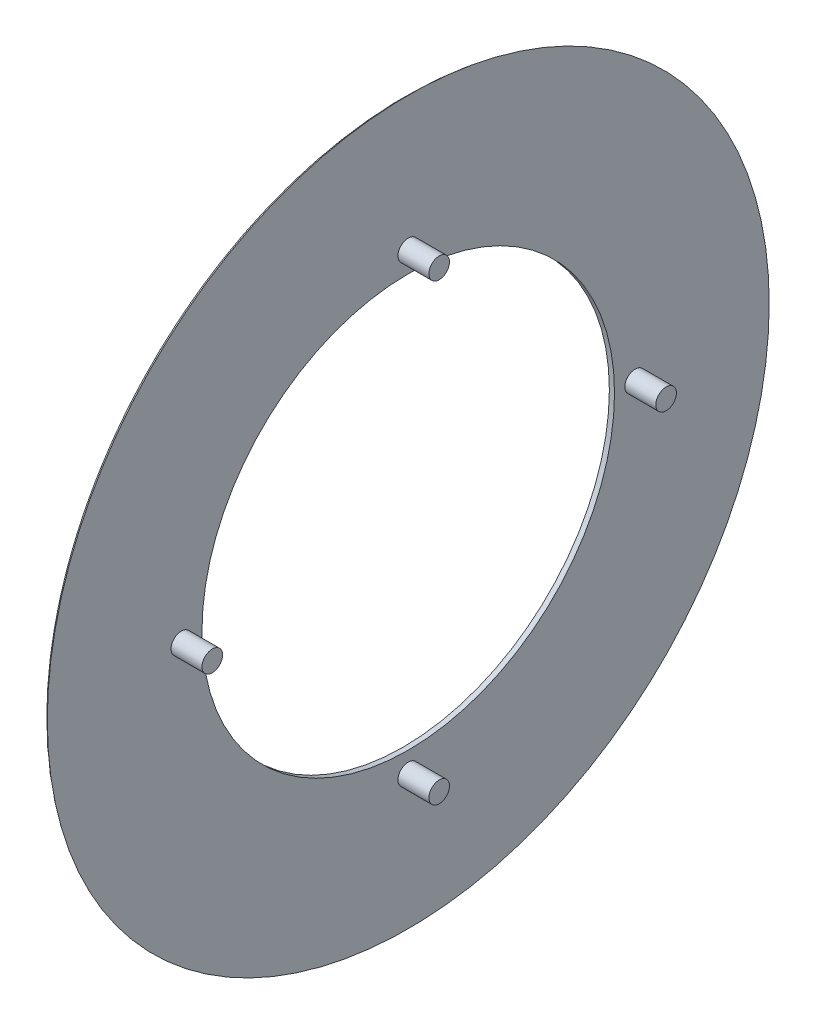
ISO-10303-21;
HEADER;
FILE_DESCRIPTION(('STEP AP214'),'2;1');
FILE_NAME('part.step','',(''),(''),'','','');
FILE_SCHEMA(('AUTOMOTIVE_DESIGN { 1 0 10303 214 1 1 1 1 }'));
ENDSEC;
DATA;
#1=APPLICATION_CONTEXT('core data for automotive mechanical design processes');
#2=APPLICATION_PROTOCOL_DEFINITION('international standard','automotive_design',2000,#1);
#3=PRODUCT_CONTEXT('',#1,'mechanical');
#4=PRODUCT('Part','Part','',(#3));
#5=PRODUCT_RELATED_PRODUCT_CATEGORY('part','',(#4));
#6=PRODUCT_DEFINITION_FORMATION('','',#4);
#7=PRODUCT_DEFINITION_CONTEXT('part definition',#1,'design');
#8=PRODUCT_DEFINITION('design','',#6,#7);
#9=PRODUCT_DEFINITION_SHAPE('','',#8);
#10=(LENGTH_UNIT() NAMED_UNIT(*) SI_UNIT(.MILLI.,.METRE.));
#11=(NAMED_UNIT(*) PLANE_ANGLE_UNIT() SI_UNIT($,.RADIAN.));
#12=(NAMED_UNIT(*) SI_UNIT($,.STERADIAN.) SOLID_ANGLE_UNIT());
#13=UNCERTAINTY_MEASURE_WITH_UNIT(LENGTH_MEASURE(1.E-05),#10,'distance_accuracy_value','');
#14=(GEOMETRIC_REPRESENTATION_CONTEXT(3) GLOBAL_UNCERTAINTY_ASSIGNED_CONTEXT((#13)) GLOBAL_UNIT_ASSIGNED_CONTEXT((#10,
#11,#12)) REPRESENTATION_CONTEXT('',''));
#15=CARTESIAN_POINT('',(0.,0.,0.));
#16=DIRECTION('',(0.,0.,1.));
#17=DIRECTION('',(1.,0.,0.));
#18=AXIS2_PLACEMENT_3D('',#15,#16,#17);
#19=CARTESIAN_POINT('',(0.635,0.,0.));
#20=DIRECTION('',(1.,0.,0.));
#21=DIRECTION('',(0.,0.,-1.));
#22=AXIS2_PLACEMENT_3D('',#19,#20,#21);
#23=PLANE('',#22);
#24=CARTESIAN_POINT('',(0.635,0.,0.));
#25=DIRECTION('',(1.,0.,0.));
#26=DIRECTION('',(0.,0.,-1.));
#27=AXIS2_PLACEMENT_3D('',#24,#25,#26);
#28=CIRCLE('',#27,25.4);
#29=CARTESIAN_POINT('',(0.635,0.,-25.4));
#30=VERTEX_POINT('',#29);
#31=EDGE_CURVE('E74',#30,#30,#28,.T.);
#32=ORIENTED_EDGE('',*,*,#31,.F.);
#33=EDGE_LOOP('',(#32));
#34=FACE_BOUND('',#33,.T.);
#35=CARTESIAN_POINT('',(0.635,-27.94,0.));
#36=DIRECTION('',(1.,0.,0.));
#37=DIRECTION('',(0.,0.,-1.));
#38=AXIS2_PLACEMENT_3D('',#35,#36,#37);
#39=CIRCLE('',#38,1.27);
#40=CARTESIAN_POINT('',(0.635,-27.94,1.26999999999999));
#41=VERTEX_POINT('',#40);
#42=EDGE_CURVE('E60',#41,#41,#39,.T.);
#43=ORIENTED_EDGE('',*,*,#42,.F.);
#44=EDGE_LOOP('',(#43));
#45=FACE_BOUND('',#44,.T.);
#46=CARTESIAN_POINT('',(0.635,27.94,0.));
#47=DIRECTION('',(1.,0.,0.));
#48=DIRECTION('',(0.,0.,-1.));
#49=AXIS2_PLACEMENT_3D('',#46,#47,#48);
#50=CIRCLE('',#49,1.27);
#51=CARTESIAN_POINT('',(0.635,27.94,1.27));
#52=VERTEX_POINT('',#51);
#53=EDGE_CURVE('E48',#52,#52,#50,.T.);
#54=ORIENTED_EDGE('',*,*,#53,.F.);
#55=EDGE_LOOP('',(#54));
#56=FACE_BOUND('',#55,.T.);
#57=CARTESIAN_POINT('',(0.635,0.,0.));
#58=DIRECTION('',(1.,0.,0.));
#59=DIRECTION('',(0.,0.,-1.));
#60=AXIS2_PLACEMENT_3D('',#57,#58,#59);
#61=CIRCLE('',#60,44.45);
#62=CARTESIAN_POINT('',(0.635,0.,-44.45));
#63=VERTEX_POINT('',#62);
#64=EDGE_CURVE('E40',#63,#63,#61,.T.);
#65=ORIENTED_EDGE('',*,*,#64,.T.);
#66=EDGE_LOOP('',(#65));
#67=FACE_BOUND('',#66,.T.);
#68=CARTESIAN_POINT('',(0.635,0.,-27.94));
#69=DIRECTION('',(1.,0.,0.));
#70=DIRECTION('',(0.,0.,-1.));
#71=AXIS2_PLACEMENT_3D('',#68,#69,#70);
#72=CIRCLE('',#71,1.27);
#73=CARTESIAN_POINT('',(0.635,0.,-26.67));
#74=VERTEX_POINT('',#73);
#75=EDGE_CURVE('E54',#74,#74,#72,.T.);
#76=ORIENTED_EDGE('',*,*,#75,.F.);
#77=EDGE_LOOP('',(#76));
#78=FACE_BOUND('',#77,.T.);
#79=CARTESIAN_POINT('',(0.635,0.,27.94));
#80=DIRECTION('',(1.,0.,0.));
#81=DIRECTION('',(0.,0.,-1.));
#82=AXIS2_PLACEMENT_3D('',#79,#80,#81);
#83=CIRCLE('',#82,1.27);
#84=CARTESIAN_POINT('',(0.635,0.,29.21));
#85=VERTEX_POINT('',#84);
#86=EDGE_CURVE('E66',#85,#85,#83,.T.);
#87=ORIENTED_EDGE('',*,*,#86,.F.);
#88=EDGE_LOOP('',(#87));
#89=FACE_BOUND('',#88,.T.);
#90=ADVANCED_FACE('F33',(#34,#45,#56,#67,#78,#89),#23,.T.);
#91=CARTESIAN_POINT('',(0.,0.,0.));
#92=DIRECTION('',(1.,0.,0.));
#93=DIRECTION('',(0.,0.,-1.));
#94=AXIS2_PLACEMENT_3D('',#91,#92,#93);
#95=PLANE('',#94);
#96=CARTESIAN_POINT('',(0.,0.,0.));
#97=DIRECTION('',(1.,0.,0.));
#98=DIRECTION('',(0.,0.,-1.));
#99=AXIS2_PLACEMENT_3D('',#96,#97,#98);
#100=CIRCLE('',#99,43.3501477371938);
#101=CARTESIAN_POINT('',(0.,0.,-43.3501477371938));
#102=VERTEX_POINT('',#101);
#103=EDGE_CURVE('E10',#102,#102,#100,.F.);
#104=ORIENTED_EDGE('',*,*,#103,.T.);
#105=EDGE_LOOP('',(#104));
#106=FACE_BOUND('',#105,.T.);
#107=CARTESIAN_POINT('',(0.,0.,0.));
#108=DIRECTION('',(1.,0.,0.));
#109=DIRECTION('',(0.,0.,-1.));
#110=AXIS2_PLACEMENT_3D('',#107,#108,#109);
#111=CIRCLE('',#110,25.4);
#112=CARTESIAN_POINT('',(0.,0.,-25.4));
#113=VERTEX_POINT('',#112);
#114=EDGE_CURVE('E69',#113,#113,#111,.F.);
#115=ORIENTED_EDGE('',*,*,#114,.F.);
#116=EDGE_LOOP('',(#115));
#117=FACE_BOUND('',#116,.T.);
#118=ADVANCED_FACE('F83',(#106,#117),#95,.F.);
#119=CARTESIAN_POINT('',(4.445,27.94,0.));
#120=DIRECTION('',(-1.,0.,0.));
#121=DIRECTION('',(0.,0.,1.));
#122=AXIS2_PLACEMENT_3D('',#119,#120,#121);
#123=CYLINDRICAL_SURFACE('',#122,1.27);
#124=CARTESIAN_POINT('',(4.445,27.94,0.));
#125=DIRECTION('',(1.,0.,0.));
#126=DIRECTION('',(0.,0.,-1.));
#127=AXIS2_PLACEMENT_3D('',#124,#125,#126);
#128=CIRCLE('',#127,1.27);
#129=CARTESIAN_POINT('',(4.445,27.94,1.27));
#130=VERTEX_POINT('',#129);
#131=EDGE_CURVE('E44',#130,#130,#128,.T.);
#132=CARTESIAN_POINT('',(4.445,27.94,1.27));
#133=CARTESIAN_POINT('',(4.4053125,27.94,1.27));
#134=CARTESIAN_POINT('',(4.365625,27.94,1.27));
#135=CARTESIAN_POINT('',(4.28625,27.94,1.27));
#136=CARTESIAN_POINT('',(4.2465625,27.94,1.27));
#137=CARTESIAN_POINT('',(4.1671875,27.94,1.27));
#138=CARTESIAN_POINT('',(4.1275,27.94,1.27));
#139=CARTESIAN_POINT('',(4.048125,27.94,1.27));
#140=CARTESIAN_POINT('',(4.0084375,27.94,1.27));
#141=CARTESIAN_POINT('',(3.9290625,27.94,1.27));
#142=CARTESIAN_POINT('',(3.889375,27.94,1.27));
#143=CARTESIAN_POINT('',(3.81,27.94,1.27));
#144=CARTESIAN_POINT('',(3.7703125,27.94,1.27));
#145=CARTESIAN_POINT('',(3.6909375,27.94,1.27));
#146=CARTESIAN_POINT('',(3.65125,27.94,1.27));
#147=CARTESIAN_POINT('',(3.571875,27.94,1.27));
#148=CARTESIAN_POINT('',(3.5321875,27.94,1.27));
#149=CARTESIAN_POINT('',(3.4528125,27.94,1.27));
#150=CARTESIAN_POINT('',(3.413125,27.94,1.27));
#151=CARTESIAN_POINT('',(3.33375,27.94,1.27));
#152=CARTESIAN_POINT('',(3.2940625,27.94,1.27));
#153=CARTESIAN_POINT('',(3.2146875,27.94,1.27));
#154=CARTESIAN_POINT('',(3.175,27.94,1.27));
#155=CARTESIAN_POINT('',(3.095625,27.94,1.27));
#156=CARTESIAN_POINT('',(3.0559375,27.94,1.27));
#157=CARTESIAN_POINT('',(2.9765625,27.94,1.27));
#158=CARTESIAN_POINT('',(2.936875,27.94,1.27));
#159=CARTESIAN_POINT('',(2.8575,27.94,1.27));
#160=CARTESIAN_POINT('',(2.8178125,27.94,1.27));
#161=CARTESIAN_POINT('',(2.7384375,27.94,1.27));
#162=CARTESIAN_POINT('',(2.69875,27.94,1.27));
#163=CARTESIAN_POINT('',(2.619375,27.94,1.27));
#164=CARTESIAN_POINT('',(2.5796875,27.94,1.27));
#165=CARTESIAN_POINT('',(2.5003125,27.94,1.27));
#166=CARTESIAN_POINT('',(2.460625,27.94,1.27));
#167=CARTESIAN_POINT('',(2.38125,27.94,1.27));
#168=CARTESIAN_POINT('',(2.3415625,27.94,1.27));
#169=CARTESIAN_POINT('',(2.2621875,27.94,1.27));
#170=CARTESIAN_POINT('',(2.2225,27.94,1.27));
#171=CARTESIAN_POINT('',(2.143125,27.94,1.27));
#172=CARTESIAN_POINT('',(2.1034375,27.94,1.27));
#173=CARTESIAN_POINT('',(2.0240625,27.94,1.27));
#174=CARTESIAN_POINT('',(1.984375,27.94,1.27));
#175=CARTESIAN_POINT('',(1.905,27.94,1.27));
#176=CARTESIAN_POINT('',(1.8653125,27.94,1.27));
#177=CARTESIAN_POINT('',(1.7859375,27.94,1.27));
#178=CARTESIAN_POINT('',(1.74625,27.94,1.27));
#179=CARTESIAN_POINT('',(1.666875,27.94,1.27));
#180=CARTESIAN_POINT('',(1.6271875,27.94,1.27));
#181=CARTESIAN_POINT('',(1.5478125,27.94,1.27));
#182=CARTESIAN_POINT('',(1.508125,27.94,1.27));
#183=CARTESIAN_POINT('',(1.42875,27.94,1.27));
#184=CARTESIAN_POINT('',(1.3890625,27.94,1.27));
#185=CARTESIAN_POINT('',(1.3096875,27.94,1.27));
#186=CARTESIAN_POINT('',(1.27,27.94,1.27));
#187=CARTESIAN_POINT('',(1.190625,27.94,1.27));
#188=CARTESIAN_POINT('',(1.1509375,27.94,1.27));
#189=CARTESIAN_POINT('',(1.0715625,27.94,1.27));
#190=CARTESIAN_POINT('',(1.031875,27.94,1.27));
#191=CARTESIAN_POINT('',(0.9525,27.94,1.27));
#192=CARTESIAN_POINT('',(0.9128125,27.94,1.27));
#193=CARTESIAN_POINT('',(0.8334375,27.94,1.27));
#194=CARTESIAN_POINT('',(0.79375,27.94,1.27));
#195=CARTESIAN_POINT('',(0.714375,27.94,1.27));
#196=CARTESIAN_POINT('',(0.6746875,27.94,1.27));
#197=CARTESIAN_POINT('',(0.635,27.94,1.27));
#198=B_SPLINE_CURVE_WITH_KNOTS('',3,(#132,#133,#134,#135,#136,#137,#138,#139,#140,#141,#142,
#143,#144,#145,#146,#147,#148,#149,#150,#151,#152,#153,#154,#155,#156,#157,#158,#159,#160,#161,
#162,#163,#164,#165,#166,#167,#168,#169,#170,#171,#172,#173,#174,#175,#176,#177,#178,#179,#180,
#181,#182,#183,#184,#185,#186,#187,#188,#189,#190,#191,#192,#193,#194,#195,#196,#197),
.UNSPECIFIED.,.F.,.F.,(4,2,2,2,2,2,2,2,2,2,2,2,2,2,2,2,2,2,2,2,2,2,2,2,2,2,2,2,2,2,2,2,4),(0.,
0.119062499999999,0.238125,0.3571875,0.476249999999999,0.595312499999999,0.714374999999999,
0.833437499999999,0.952499999999999,1.0715625,1.190625,1.3096875,1.42875,1.5478125,1.666875,
1.7859375,1.905,2.0240625,2.143125,2.2621875,2.38125,2.5003125,2.619375,2.7384375,2.8575,
2.9765625,3.095625,3.2146875,3.33375,3.4528125,3.571875,3.6909375,3.81),.UNSPECIFIED.);
#199=EDGE_CURVE('BSEAM125',#130,#52,#198,.T.);
#200=ORIENTED_EDGE('',*,*,#131,.F.);
#201=ORIENTED_EDGE('',*,*,#53,.T.);
#202=ORIENTED_EDGE('',*,*,#199,.T.);
#203=ORIENTED_EDGE('',*,*,#199,.F.);
#204=EDGE_LOOP('',(#200,#202,#201,#203));
#205=FACE_BOUND('',#204,.T.);
#206=ADVANCED_FACE('F125',(#205),#123,.T.);
#207=CARTESIAN_POINT('',(4.445,27.94,0.));
#208=DIRECTION('',(1.,0.,0.));
#209=DIRECTION('',(0.,0.,-1.));
#210=AXIS2_PLACEMENT_3D('',#207,#208,#209);
#211=PLANE('',#210);
#212=ORIENTED_EDGE('',*,*,#131,.T.);
#213=EDGE_LOOP('',(#212));
#214=FACE_BOUND('',#213,.T.);
#215=ADVANCED_FACE('F121',(#214),#211,.T.);
#216=CARTESIAN_POINT('',(4.445,0.,-27.94));
#217=DIRECTION('',(-1.,0.,0.));
#218=DIRECTION('',(0.,0.,1.));
#219=AXIS2_PLACEMENT_3D('',#216,#217,#218);
#220=CYLINDRICAL_SURFACE('',#219,1.27);
#221=CARTESIAN_POINT('',(4.445,0.,-27.94));
#222=DIRECTION('',(1.,0.,0.));
#223=DIRECTION('',(0.,0.,-1.));
#224=AXIS2_PLACEMENT_3D('',#221,#222,#223);
#225=CIRCLE('',#224,1.27);
#226=CARTESIAN_POINT('',(4.445,0.,-26.67));
#227=VERTEX_POINT('',#226);
#228=EDGE_CURVE('E52',#227,#227,#225,.T.);
#229=CARTESIAN_POINT('',(4.445,0.,-26.67));
#230=CARTESIAN_POINT('',(4.4053125,0.,-26.67));
#231=CARTESIAN_POINT('',(4.365625,0.,-26.67));
#232=CARTESIAN_POINT('',(4.28625,0.,-26.67));
#233=CARTESIAN_POINT('',(4.2465625,0.,-26.67));
#234=CARTESIAN_POINT('',(4.1671875,0.,-26.67));
#235=CARTESIAN_POINT('',(4.1275,0.,-26.67));
#236=CARTESIAN_POINT('',(4.048125,0.,-26.67));
#237=CARTESIAN_POINT('',(4.0084375,0.,-26.67));
#238=CARTESIAN_POINT('',(3.9290625,0.,-26.67));
#239=CARTESIAN_POINT('',(3.889375,0.,-26.67));
#240=CARTESIAN_POINT('',(3.81,0.,-26.67));
#241=CARTESIAN_POINT('',(3.7703125,0.,-26.67));
#242=CARTESIAN_POINT('',(3.6909375,0.,-26.67));
#243=CARTESIAN_POINT('',(3.65125,0.,-26.67));
#244=CARTESIAN_POINT('',(3.571875,0.,-26.67));
#245=CARTESIAN_POINT('',(3.5321875,0.,-26.67));
#246=CARTESIAN_POINT('',(3.4528125,0.,-26.67));
#247=CARTESIAN_POINT('',(3.413125,0.,-26.67));
#248=CARTESIAN_POINT('',(3.33375,0.,-26.67));
#249=CARTESIAN_POINT('',(3.2940625,0.,-26.67));
#250=CARTESIAN_POINT('',(3.2146875,0.,-26.67));
#251=CARTESIAN_POINT('',(3.175,0.,-26.67));
#252=CARTESIAN_POINT('',(3.095625,0.,-26.67));
#253=CARTESIAN_POINT('',(3.0559375,0.,-26.67));
#254=CARTESIAN_POINT('',(2.9765625,0.,-26.67));
#255=CARTESIAN_POINT('',(2.936875,0.,-26.67));
#256=CARTESIAN_POINT('',(2.8575,0.,-26.67));
#257=CARTESIAN_POINT('',(2.8178125,0.,-26.67));
#258=CARTESIAN_POINT('',(2.7384375,0.,-26.67));
#259=CARTESIAN_POINT('',(2.69875,0.,-26.67));
#260=CARTESIAN_POINT('',(2.619375,0.,-26.67));
#261=CARTESIAN_POINT('',(2.5796875,0.,-26.67));
#262=CARTESIAN_POINT('',(2.5003125,0.,-26.67));
#263=CARTESIAN_POINT('',(2.460625,0.,-26.67));
#264=CARTESIAN_POINT('',(2.38125,0.,-26.67));
#265=CARTESIAN_POINT('',(2.3415625,0.,-26.67));
#266=CARTESIAN_POINT('',(2.2621875,0.,-26.67));
#267=CARTESIAN_POINT('',(2.2225,0.,-26.67));
#268=CARTESIAN_POINT('',(2.143125,0.,-26.67));
#269=CARTESIAN_POINT('',(2.1034375,0.,-26.67));
#270=CARTESIAN_POINT('',(2.0240625,0.,-26.67));
#271=CARTESIAN_POINT('',(1.984375,0.,-26.67));
#272=CARTESIAN_POINT('',(1.905,0.,-26.67));
#273=CARTESIAN_POINT('',(1.8653125,0.,-26.67));
#274=CARTESIAN_POINT('',(1.7859375,0.,-26.67));
#275=CARTESIAN_POINT('',(1.74625,0.,-26.67));
#276=CARTESIAN_POINT('',(1.666875,0.,-26.67));
#277=CARTESIAN_POINT('',(1.6271875,0.,-26.67));
#278=CARTESIAN_POINT('',(1.5478125,0.,-26.67));
#279=CARTESIAN_POINT('',(1.508125,0.,-26.67));
#280=CARTESIAN_POINT('',(1.42875,0.,-26.67));
#281=CARTESIAN_POINT('',(1.3890625,0.,-26.67));
#282=CARTESIAN_POINT('',(1.3096875,0.,-26.67));
#283=CARTESIAN_POINT('',(1.27,0.,-26.67));
#284=CARTESIAN_POINT('',(1.190625,0.,-26.67));
#285=CARTESIAN_POINT('',(1.1509375,0.,-26.67));
#286=CARTESIAN_POINT('',(1.0715625,0.,-26.67));
#287=CARTESIAN_POINT('',(1.031875,0.,-26.67));
#288=CARTESIAN_POINT('',(0.9525,0.,-26.67));
#289=CARTESIAN_POINT('',(0.9128125,0.,-26.67));
#290=CARTESIAN_POINT('',(0.8334375,0.,-26.67));
#291=CARTESIAN_POINT('',(0.79375,0.,-26.67));
#292=CARTESIAN_POINT('',(0.714375,0.,-26.67));
#293=CARTESIAN_POINT('',(0.6746875,0.,-26.67));
#294=CARTESIAN_POINT('',(0.635,0.,-26.67));
#295=B_SPLINE_CURVE_WITH_KNOTS('',3,(#229,#230,#231,#232,#233,#234,#235,#236,#237,#238,#239,
#240,#241,#242,#243,#244,#245,#246,#247,#248,#249,#250,#251,#252,#253,#254,#255,#256,#257,#258,
#259,#260,#261,#262,#263,#264,#265,#266,#267,#268,#269,#270,#271,#272,#273,#274,#275,#276,#277,
#278,#279,#280,#281,#282,#283,#284,#285,#286,#287,#288,#289,#290,#291,#292,#293,#294),
.UNSPECIFIED.,.F.,.F.,(4,2,2,2,2,2,2,2,2,2,2,2,2,2,2,2,2,2,2,2,2,2,2,2,2,2,2,2,2,2,2,2,4),(0.,
0.119062499999999,0.238125,0.3571875,0.476249999999999,0.595312499999999,0.714374999999999,
0.833437499999999,0.952499999999999,1.0715625,1.190625,1.3096875,1.42875,1.5478125,1.666875,
1.7859375,1.905,2.0240625,2.143125,2.2621875,2.38125,2.5003125,2.619375,2.7384375,2.8575,
2.9765625,3.095625,3.2146875,3.33375,3.4528125,3.571875,3.6909375,3.81),.UNSPECIFIED.);
#296=EDGE_CURVE('BSEAM117',#227,#74,#295,.T.);
#297=ORIENTED_EDGE('',*,*,#228,.F.);
#298=ORIENTED_EDGE('',*,*,#75,.T.);
#299=ORIENTED_EDGE('',*,*,#296,.T.);
#300=ORIENTED_EDGE('',*,*,#296,.F.);
#301=EDGE_LOOP('',(#297,#299,#298,#300));
#302=FACE_BOUND('',#301,.T.);
#303=ADVANCED_FACE('F117',(#302),#220,.T.);
#304=CARTESIAN_POINT('',(4.445,0.,-27.94));
#305=DIRECTION('',(1.,0.,0.));
#306=DIRECTION('',(0.,0.,-1.));
#307=AXIS2_PLACEMENT_3D('',#304,#305,#306);
#308=PLANE('',#307);
#309=ORIENTED_EDGE('',*,*,#228,.T.);
#310=EDGE_LOOP('',(#309));
#311=FACE_BOUND('',#310,.T.);
#312=ADVANCED_FACE('F113',(#311),#308,.T.);
#313=CARTESIAN_POINT('',(4.445,-27.94,0.));
#314=DIRECTION('',(-1.,0.,0.));
#315=DIRECTION('',(0.,0.,1.));
#316=AXIS2_PLACEMENT_3D('',#313,#314,#315);
#317=CYLINDRICAL_SURFACE('',#316,1.27);
#318=CARTESIAN_POINT('',(4.445,-27.94,0.));
#319=DIRECTION('',(1.,0.,0.));
#320=DIRECTION('',(0.,0.,-1.));
#321=AXIS2_PLACEMENT_3D('',#318,#319,#320);
#322=CIRCLE('',#321,1.27);
#323=CARTESIAN_POINT('',(4.445,-27.94,1.26999999999999));
#324=VERTEX_POINT('',#323);
#325=EDGE_CURVE('E57',#324,#324,#322,.T.);
#326=CARTESIAN_POINT('',(4.445,-27.94,1.26999999999999));
#327=CARTESIAN_POINT('',(4.4053125,-27.94,1.26999999999999));
#328=CARTESIAN_POINT('',(4.365625,-27.94,1.26999999999999));
#329=CARTESIAN_POINT('',(4.28625,-27.94,1.26999999999999));
#330=CARTESIAN_POINT('',(4.2465625,-27.94,1.26999999999999));
#331=CARTESIAN_POINT('',(4.1671875,-27.94,1.26999999999999));
#332=CARTESIAN_POINT('',(4.1275,-27.94,1.26999999999999));
#333=CARTESIAN_POINT('',(4.048125,-27.94,1.26999999999999));
#334=CARTESIAN_POINT('',(4.0084375,-27.94,1.26999999999999));
#335=CARTESIAN_POINT('',(3.9290625,-27.94,1.26999999999999));
#336=CARTESIAN_POINT('',(3.889375,-27.94,1.26999999999999));
#337=CARTESIAN_POINT('',(3.81,-27.94,1.26999999999999));
#338=CARTESIAN_POINT('',(3.7703125,-27.94,1.26999999999999));
#339=CARTESIAN_POINT('',(3.6909375,-27.94,1.26999999999999));
#340=CARTESIAN_POINT('',(3.65125,-27.94,1.26999999999999));
#341=CARTESIAN_POINT('',(3.571875,-27.94,1.26999999999999));
#342=CARTESIAN_POINT('',(3.5321875,-27.94,1.26999999999999));
#343=CARTESIAN_POINT('',(3.4528125,-27.94,1.26999999999999));
#344=CARTESIAN_POINT('',(3.413125,-27.94,1.26999999999999));
#345=CARTESIAN_POINT('',(3.33375,-27.94,1.26999999999999));
#346=CARTESIAN_POINT('',(3.2940625,-27.94,1.26999999999999));
#347=CARTESIAN_POINT('',(3.2146875,-27.94,1.26999999999999));
#348=CARTESIAN_POINT('',(3.175,-27.94,1.26999999999999));
#349=CARTESIAN_POINT('',(3.095625,-27.94,1.26999999999999));
#350=CARTESIAN_POINT('',(3.0559375,-27.94,1.26999999999999));
#351=CARTESIAN_POINT('',(2.9765625,-27.94,1.26999999999999));
#352=CARTESIAN_POINT('',(2.936875,-27.94,1.26999999999999));
#353=CARTESIAN_POINT('',(2.8575,-27.94,1.26999999999999));
#354=CARTESIAN_POINT('',(2.8178125,-27.94,1.26999999999999));
#355=CARTESIAN_POINT('',(2.7384375,-27.94,1.26999999999999));
#356=CARTESIAN_POINT('',(2.69875,-27.94,1.26999999999999));
#357=CARTESIAN_POINT('',(2.619375,-27.94,1.26999999999999));
#358=CARTESIAN_POINT('',(2.5796875,-27.94,1.26999999999999));
#359=CARTESIAN_POINT('',(2.5003125,-27.94,1.26999999999999));
#360=CARTESIAN_POINT('',(2.460625,-27.94,1.26999999999999));
#361=CARTESIAN_POINT('',(2.38125,-27.94,1.26999999999999));
#362=CARTESIAN_POINT('',(2.3415625,-27.94,1.26999999999999));
#363=CARTESIAN_POINT('',(2.2621875,-27.94,1.26999999999999));
#364=CARTESIAN_POINT('',(2.2225,-27.94,1.26999999999999));
#365=CARTESIAN_POINT('',(2.143125,-27.94,1.26999999999999));
#366=CARTESIAN_POINT('',(2.1034375,-27.94,1.26999999999999));
#367=CARTESIAN_POINT('',(2.0240625,-27.94,1.26999999999999));
#368=CARTESIAN_POINT('',(1.984375,-27.94,1.26999999999999));
#369=CARTESIAN_POINT('',(1.905,-27.94,1.26999999999999));
#370=CARTESIAN_POINT('',(1.8653125,-27.94,1.26999999999999));
#371=CARTESIAN_POINT('',(1.7859375,-27.94,1.26999999999999));
#372=CARTESIAN_POINT('',(1.74625,-27.94,1.26999999999999));
#373=CARTESIAN_POINT('',(1.666875,-27.94,1.26999999999999));
#374=CARTESIAN_POINT('',(1.6271875,-27.94,1.26999999999999));
#375=CARTESIAN_POINT('',(1.5478125,-27.94,1.26999999999999));
#376=CARTESIAN_POINT('',(1.508125,-27.94,1.26999999999999));
#377=CARTESIAN_POINT('',(1.42875,-27.94,1.26999999999999));
#378=CARTESIAN_POINT('',(1.3890625,-27.94,1.26999999999999));
#379=CARTESIAN_POINT('',(1.3096875,-27.94,1.26999999999999));
#380=CARTESIAN_POINT('',(1.27,-27.94,1.26999999999999));
#381=CARTESIAN_POINT('',(1.190625,-27.94,1.26999999999999));
#382=CARTESIAN_POINT('',(1.1509375,-27.94,1.26999999999999));
#383=CARTESIAN_POINT('',(1.0715625,-27.94,1.26999999999999));
#384=CARTESIAN_POINT('',(1.031875,-27.94,1.26999999999999));
#385=CARTESIAN_POINT('',(0.9525,-27.94,1.26999999999999));
#386=CARTESIAN_POINT('',(0.9128125,-27.94,1.26999999999999));
#387=CARTESIAN_POINT('',(0.8334375,-27.94,1.26999999999999));
#388=CARTESIAN_POINT('',(0.79375,-27.94,1.26999999999999));
#389=CARTESIAN_POINT('',(0.714375,-27.94,1.26999999999999));
#390=CARTESIAN_POINT('',(0.6746875,-27.94,1.26999999999999));
#391=CARTESIAN_POINT('',(0.635,-27.94,1.26999999999999));
#392=B_SPLINE_CURVE_WITH_KNOTS('',3,(#326,#327,#328,#329,#330,#331,#332,#333,#334,#335,#336,
#337,#338,#339,#340,#341,#342,#343,#344,#345,#346,#347,#348,#349,#350,#351,#352,#353,#354,#355,
#356,#357,#358,#359,#360,#361,#362,#363,#364,#365,#366,#367,#368,#369,#370,#371,#372,#373,#374,
#375,#376,#377,#378,#379,#380,#381,#382,#383,#384,#385,#386,#387,#388,#389,#390,#391),
.UNSPECIFIED.,.F.,.F.,(4,2,2,2,2,2,2,2,2,2,2,2,2,2,2,2,2,2,2,2,2,2,2,2,2,2,2,2,2,2,2,2,4),(0.,
0.119062499999999,0.238125,0.3571875,0.476249999999999,0.595312499999999,0.714374999999999,
0.833437499999999,0.952499999999999,1.0715625,1.190625,1.3096875,1.42875,1.5478125,1.666875,
1.7859375,1.905,2.0240625,2.143125,2.2621875,2.38125,2.5003125,2.619375,2.7384375,2.8575,
2.9765625,3.095625,3.2146875,3.33375,3.4528125,3.571875,3.6909375,3.81),.UNSPECIFIED.);
#393=EDGE_CURVE('BSEAM105',#324,#41,#392,.T.);
#394=ORIENTED_EDGE('',*,*,#325,.F.);
#395=ORIENTED_EDGE('',*,*,#42,.T.);
#396=ORIENTED_EDGE('',*,*,#393,.T.);
#397=ORIENTED_EDGE('',*,*,#393,.F.);
#398=EDGE_LOOP('',(#394,#396,#395,#397));
#399=FACE_BOUND('',#398,.T.);
#400=ADVANCED_FACE('F105',(#399),#317,.T.);
#401=CARTESIAN_POINT('',(4.445,-27.94,0.));
#402=DIRECTION('',(1.,0.,0.));
#403=DIRECTION('',(0.,0.,-1.));
#404=AXIS2_PLACEMENT_3D('',#401,#402,#403);
#405=PLANE('',#404);
#406=ORIENTED_EDGE('',*,*,#325,.T.);
#407=EDGE_LOOP('',(#406));
#408=FACE_BOUND('',#407,.T.);
#409=ADVANCED_FACE('F96',(#408),#405,.T.);
#410=CARTESIAN_POINT('',(4.445,0.,27.94));
#411=DIRECTION('',(-1.,0.,0.));
#412=DIRECTION('',(0.,0.,1.));
#413=AXIS2_PLACEMENT_3D('',#410,#411,#412);
#414=CYLINDRICAL_SURFACE('',#413,1.27);
#415=CARTESIAN_POINT('',(4.445,0.,27.94));
#416=DIRECTION('',(1.,0.,0.));
#417=DIRECTION('',(0.,0.,-1.));
#418=AXIS2_PLACEMENT_3D('',#415,#416,#417);
#419=CIRCLE('',#418,1.27);
#420=CARTESIAN_POINT('',(4.445,0.,29.21));
#421=VERTEX_POINT('',#420);
#422=EDGE_CURVE('E63',#421,#421,#419,.T.);
#423=CARTESIAN_POINT('',(4.445,0.,29.21));
#424=CARTESIAN_POINT('',(4.4053125,0.,29.21));
#425=CARTESIAN_POINT('',(4.365625,0.,29.21));
#426=CARTESIAN_POINT('',(4.28625,0.,29.21));
#427=CARTESIAN_POINT('',(4.2465625,0.,29.21));
#428=CARTESIAN_POINT('',(4.1671875,0.,29.21));
#429=CARTESIAN_POINT('',(4.1275,0.,29.21));
#430=CARTESIAN_POINT('',(4.048125,0.,29.21));
#431=CARTESIAN_POINT('',(4.0084375,0.,29.21));
#432=CARTESIAN_POINT('',(3.9290625,0.,29.21));
#433=CARTESIAN_POINT('',(3.889375,0.,29.21));
#434=CARTESIAN_POINT('',(3.81,0.,29.21));
#435=CARTESIAN_POINT('',(3.7703125,0.,29.21));
#436=CARTESIAN_POINT('',(3.6909375,0.,29.21));
#437=CARTESIAN_POINT('',(3.65125,0.,29.21));
#438=CARTESIAN_POINT('',(3.571875,0.,29.21));
#439=CARTESIAN_POINT('',(3.5321875,0.,29.21));
#440=CARTESIAN_POINT('',(3.4528125,0.,29.21));
#441=CARTESIAN_POINT('',(3.413125,0.,29.21));
#442=CARTESIAN_POINT('',(3.33375,0.,29.21));
#443=CARTESIAN_POINT('',(3.2940625,0.,29.21));
#444=CARTESIAN_POINT('',(3.2146875,0.,29.21));
#445=CARTESIAN_POINT('',(3.175,0.,29.21));
#446=CARTESIAN_POINT('',(3.095625,0.,29.21));
#447=CARTESIAN_POINT('',(3.0559375,0.,29.21));
#448=CARTESIAN_POINT('',(2.9765625,0.,29.21));
#449=CARTESIAN_POINT('',(2.936875,0.,29.21));
#450=CARTESIAN_POINT('',(2.8575,0.,29.21));
#451=CARTESIAN_POINT('',(2.8178125,0.,29.21));
#452=CARTESIAN_POINT('',(2.7384375,0.,29.21));
#453=CARTESIAN_POINT('',(2.69875,0.,29.21));
#454=CARTESIAN_POINT('',(2.619375,0.,29.21));
#455=CARTESIAN_POINT('',(2.5796875,0.,29.21));
#456=CARTESIAN_POINT('',(2.5003125,0.,29.21));
#457=CARTESIAN_POINT('',(2.460625,0.,29.21));
#458=CARTESIAN_POINT('',(2.38125,0.,29.21));
#459=CARTESIAN_POINT('',(2.3415625,0.,29.21));
#460=CARTESIAN_POINT('',(2.2621875,0.,29.21));
#461=CARTESIAN_POINT('',(2.2225,0.,29.21));
#462=CARTESIAN_POINT('',(2.143125,0.,29.21));
#463=CARTESIAN_POINT('',(2.1034375,0.,29.21));
#464=CARTESIAN_POINT('',(2.0240625,0.,29.21));
#465=CARTESIAN_POINT('',(1.984375,0.,29.21));
#466=CARTESIAN_POINT('',(1.905,0.,29.21));
#467=CARTESIAN_POINT('',(1.8653125,0.,29.21));
#468=CARTESIAN_POINT('',(1.7859375,0.,29.21));
#469=CARTESIAN_POINT('',(1.74625,0.,29.21));
#470=CARTESIAN_POINT('',(1.666875,0.,29.21));
#471=CARTESIAN_POINT('',(1.6271875,0.,29.21));
#472=CARTESIAN_POINT('',(1.5478125,0.,29.21));
#473=CARTESIAN_POINT('',(1.508125,0.,29.21));
#474=CARTESIAN_POINT('',(1.42875,0.,29.21));
#475=CARTESIAN_POINT('',(1.3890625,0.,29.21));
#476=CARTESIAN_POINT('',(1.3096875,0.,29.21));
#477=CARTESIAN_POINT('',(1.27,0.,29.21));
#478=CARTESIAN_POINT('',(1.190625,0.,29.21));
#479=CARTESIAN_POINT('',(1.1509375,0.,29.21));
#480=CARTESIAN_POINT('',(1.0715625,0.,29.21));
#481=CARTESIAN_POINT('',(1.031875,0.,29.21));
#482=CARTESIAN_POINT('',(0.9525,0.,29.21));
#483=CARTESIAN_POINT('',(0.9128125,0.,29.21));
#484=CARTESIAN_POINT('',(0.8334375,0.,29.21));
#485=CARTESIAN_POINT('',(0.79375,0.,29.21));
#486=CARTESIAN_POINT('',(0.714375,0.,29.21));
#487=CARTESIAN_POINT('',(0.6746875,0.,29.21));
#488=CARTESIAN_POINT('',(0.635,0.,29.21));
#489=B_SPLINE_CURVE_WITH_KNOTS('',3,(#423,#424,#425,#426,#427,#428,#429,#430,#431,#432,#433,
#434,#435,#436,#437,#438,#439,#440,#441,#442,#443,#444,#445,#446,#447,#448,#449,#450,#451,#452,
#453,#454,#455,#456,#457,#458,#459,#460,#461,#462,#463,#464,#465,#466,#467,#468,#469,#470,#471,
#472,#473,#474,#475,#476,#477,#478,#479,#480,#481,#482,#483,#484,#485,#486,#487,#488),
.UNSPECIFIED.,.F.,.F.,(4,2,2,2,2,2,2,2,2,2,2,2,2,2,2,2,2,2,2,2,2,2,2,2,2,2,2,2,2,2,2,2,4),(0.,
0.119062499999999,0.238125,0.3571875,0.476249999999999,0.595312499999999,0.714374999999999,
0.833437499999999,0.952499999999999,1.0715625,1.190625,1.3096875,1.42875,1.5478125,1.666875,
1.7859375,1.905,2.0240625,2.143125,2.2621875,2.38125,2.5003125,2.619375,2.7384375,2.8575,
2.9765625,3.095625,3.2146875,3.33375,3.4528125,3.571875,3.6909375,3.81),.UNSPECIFIED.);
#490=EDGE_CURVE('BSEAM93',#421,#85,#489,.T.);
#491=ORIENTED_EDGE('',*,*,#422,.F.);
#492=ORIENTED_EDGE('',*,*,#86,.T.);
#493=ORIENTED_EDGE('',*,*,#490,.T.);
#494=ORIENTED_EDGE('',*,*,#490,.F.);
#495=EDGE_LOOP('',(#491,#493,#492,#494));
#496=FACE_BOUND('',#495,.T.);
#497=ADVANCED_FACE('F93',(#496),#414,.T.);
#498=CARTESIAN_POINT('',(4.445,0.,27.94));
#499=DIRECTION('',(1.,0.,0.));
#500=DIRECTION('',(0.,0.,-1.));
#501=AXIS2_PLACEMENT_3D('',#498,#499,#500);
#502=PLANE('',#501);
#503=ORIENTED_EDGE('',*,*,#422,.T.);
#504=EDGE_LOOP('',(#503));
#505=FACE_BOUND('',#504,.T.);
#506=ADVANCED_FACE('F95',(#505),#502,.T.);
#507=CARTESIAN_POINT('',(-0.00100000000000002,0.,0.));
#508=DIRECTION('',(1.,0.,0.));
#509=DIRECTION('',(0.,0.,-1.));
#510=AXIS2_PLACEMENT_3D('',#507,#508,#509);
#511=CYLINDRICAL_SURFACE('',#510,25.4);
#512=CARTESIAN_POINT('',(0.635,0.,-25.4));
#513=CARTESIAN_POINT('',(0.628385416666667,0.,-25.4));
#514=CARTESIAN_POINT('',(0.621770833333333,0.,-25.4));
#515=CARTESIAN_POINT('',(0.608541666666667,0.,-25.4));
#516=CARTESIAN_POINT('',(0.601927083333333,0.,-25.4));
#517=CARTESIAN_POINT('',(0.588697916666667,0.,-25.4));
#518=CARTESIAN_POINT('',(0.582083333333333,0.,-25.4));
#519=CARTESIAN_POINT('',(0.568854166666667,0.,-25.4));
#520=CARTESIAN_POINT('',(0.562239583333333,0.,-25.4));
#521=CARTESIAN_POINT('',(0.549010416666667,0.,-25.4));
#522=CARTESIAN_POINT('',(0.542395833333333,0.,-25.4));
#523=CARTESIAN_POINT('',(0.529166666666667,0.,-25.4));
#524=CARTESIAN_POINT('',(0.522552083333333,0.,-25.4));
#525=CARTESIAN_POINT('',(0.509322916666667,0.,-25.4));
#526=CARTESIAN_POINT('',(0.502708333333333,0.,-25.4));
#527=CARTESIAN_POINT('',(0.489479166666667,0.,-25.4));
#528=CARTESIAN_POINT('',(0.482864583333333,0.,-25.4));
#529=CARTESIAN_POINT('',(0.469635416666667,0.,-25.4));
#530=CARTESIAN_POINT('',(0.463020833333333,0.,-25.4));
#531=CARTESIAN_POINT('',(0.449791666666667,0.,-25.4));
#532=CARTESIAN_POINT('',(0.443177083333333,0.,-25.4));
#533=CARTESIAN_POINT('',(0.429947916666667,0.,-25.4));
#534=CARTESIAN_POINT('',(0.423333333333333,0.,-25.4));
#535=CARTESIAN_POINT('',(0.410104166666667,0.,-25.4));
#536=CARTESIAN_POINT('',(0.403489583333333,0.,-25.4));
#537=CARTESIAN_POINT('',(0.390260416666667,0.,-25.4));
#538=CARTESIAN_POINT('',(0.383645833333333,0.,-25.4));
#539=CARTESIAN_POINT('',(0.370416666666667,0.,-25.4));
#540=CARTESIAN_POINT('',(0.363802083333333,0.,-25.4));
#541=CARTESIAN_POINT('',(0.350572916666667,0.,-25.4));
#542=CARTESIAN_POINT('',(0.343958333333333,0.,-25.4));
#543=CARTESIAN_POINT('',(0.330729166666667,0.,-25.4));
#544=CARTESIAN_POINT('',(0.324114583333333,0.,-25.4));
#545=CARTESIAN_POINT('',(0.310885416666667,0.,-25.4));
#546=CARTESIAN_POINT('',(0.304270833333333,0.,-25.4));
#547=CARTESIAN_POINT('',(0.291041666666667,0.,-25.4));
#548=CARTESIAN_POINT('',(0.284427083333333,0.,-25.4));
#549=CARTESIAN_POINT('',(0.271197916666667,0.,-25.4));
#550=CARTESIAN_POINT('',(0.264583333333333,0.,-25.4));
#551=CARTESIAN_POINT('',(0.251354166666667,0.,-25.4));
#552=CARTESIAN_POINT('',(0.244739583333333,0.,-25.4));
#553=CARTESIAN_POINT('',(0.231510416666667,0.,-25.4));
#554=CARTESIAN_POINT('',(0.224895833333333,0.,-25.4));
#555=CARTESIAN_POINT('',(0.211666666666667,0.,-25.4));
#556=CARTESIAN_POINT('',(0.205052083333333,0.,-25.4));
#557=CARTESIAN_POINT('',(0.191822916666667,0.,-25.4));
#558=CARTESIAN_POINT('',(0.185208333333333,0.,-25.4));
#559=CARTESIAN_POINT('',(0.171979166666667,0.,-25.4));
#560=CARTESIAN_POINT('',(0.165364583333333,0.,-25.4));
#561=CARTESIAN_POINT('',(0.152135416666667,0.,-25.4));
#562=CARTESIAN_POINT('',(0.145520833333333,0.,-25.4));
#563=CARTESIAN_POINT('',(0.132291666666667,0.,-25.4));
#564=CARTESIAN_POINT('',(0.125677083333333,0.,-25.4));
#565=CARTESIAN_POINT('',(0.112447916666667,0.,-25.4));
#566=CARTESIAN_POINT('',(0.105833333333333,0.,-25.4));
#567=CARTESIAN_POINT('',(0.0926041666666667,0.,-25.4));
#568=CARTESIAN_POINT('',(0.0859895833333333,0.,-25.4));
#569=CARTESIAN_POINT('',(0.0727604166666667,0.,-25.4));
#570=CARTESIAN_POINT('',(0.0661458333333333,0.,-25.4));
#571=CARTESIAN_POINT('',(0.0529166666666667,0.,-25.4));
#572=CARTESIAN_POINT('',(0.0463020833333333,0.,-25.4));
#573=CARTESIAN_POINT('',(0.0330729166666667,0.,-25.4));
#574=CARTESIAN_POINT('',(0.0264583333333333,0.,-25.4));
#575=CARTESIAN_POINT('',(0.0132291666666667,0.,-25.4));
#576=CARTESIAN_POINT('',(0.00661458333333333,0.,-25.4));
#577=CARTESIAN_POINT('',(0.,0.,-25.4));
#578=B_SPLINE_CURVE_WITH_KNOTS('',3,(#512,#513,#514,#515,#516,#517,#518,#519,#520,#521,#522,
#523,#524,#525,#526,#527,#528,#529,#530,#531,#532,#533,#534,#535,#536,#537,#538,#539,#540,#541,
#542,#543,#544,#545,#546,#547,#548,#549,#550,#551,#552,#553,#554,#555,#556,#557,#558,#559,#560,
#561,#562,#563,#564,#565,#566,#567,#568,#569,#570,#571,#572,#573,#574,#575,#576,#577),
.UNSPECIFIED.,.F.,.F.,(4,2,2,2,2,2,2,2,2,2,2,2,2,2,2,2,2,2,2,2,2,2,2,2,2,2,2,2,2,2,2,2,4),(0.,
0.01984375,0.0396875,0.05953125,0.079375,0.09921875,0.1190625,0.13890625,0.15875,0.17859375,
0.1984375,0.21828125,0.238125,0.25796875,0.2778125,0.29765625,0.3175,0.33734375,0.3571875,
0.37703125,0.396875,0.41671875,0.4365625,0.45640625,0.47625,0.49609375,0.5159375,0.53578125,
0.555625,0.57546875,0.5953125,0.61515625,0.635),.UNSPECIFIED.);
#579=EDGE_CURVE('BSEAM78',#30,#113,#578,.T.);
#580=ORIENTED_EDGE('',*,*,#31,.T.);
#581=ORIENTED_EDGE('',*,*,#114,.T.);
#582=ORIENTED_EDGE('',*,*,#579,.T.);
#583=ORIENTED_EDGE('',*,*,#579,.F.);
#584=EDGE_LOOP('',(#580,#582,#581,#583));
#585=FACE_BOUND('',#584,.T.);
#586=ADVANCED_FACE('F78',(#585),#511,.F.);
#587=CARTESIAN_POINT('',(1.27,0.,0.));
#588=DIRECTION('',(-1.,0.,0.));
#589=DIRECTION('',(0.,0.,1.));
#590=AXIS2_PLACEMENT_3D('',#587,#588,#589);
#591=TOROIDAL_SURFACE('',#590,43.3501477371938,1.27);
#592=ORIENTED_EDGE('',*,*,#103,.F.);
#593=EDGE_LOOP('',(#592));
#594=FACE_BOUND('',#593,.T.);
#595=ORIENTED_EDGE('',*,*,#64,.F.);
#596=EDGE_LOOP('',(#595));
#597=FACE_BOUND('',#596,.T.);
#598=ADVANCED_FACE('F35',(#594,#597),#591,.T.);
#599=CLOSED_SHELL('',(#90,#118,#206,#215,#303,#312,#400,#409,#497,#506,#586,#598));
#600=MANIFOLD_SOLID_BREP('B2',#599);
#601=ADVANCED_BREP_SHAPE_REPRESENTATION('',(#18,#600),#14);
#602=SHAPE_DEFINITION_REPRESENTATION(#9,#601);
ENDSEC;
END-ISO-10303-21;
